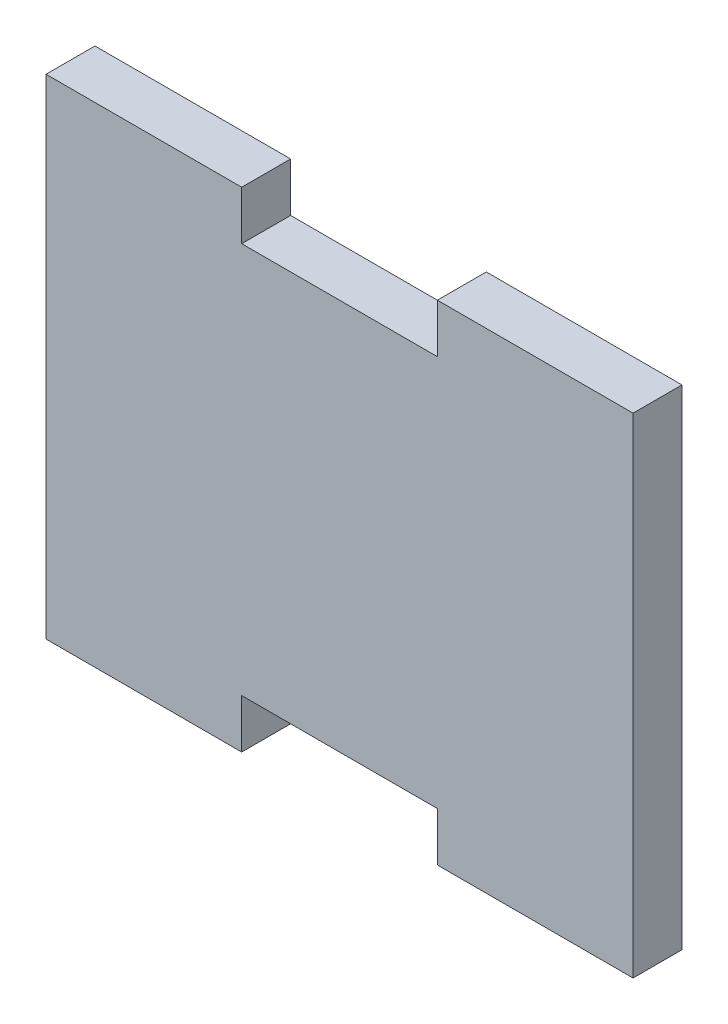
ISO-10303-21;
HEADER;
FILE_DESCRIPTION(('STEP AP214'),'2;1');
FILE_NAME('part.step','',(''),(''),'','','');
FILE_SCHEMA(('AUTOMOTIVE_DESIGN { 1 0 10303 214 1 1 1 1 }'));
ENDSEC;
DATA;
#1=APPLICATION_CONTEXT('core data for automotive mechanical design processes');
#2=APPLICATION_PROTOCOL_DEFINITION('international standard','automotive_design',2000,#1);
#3=PRODUCT_CONTEXT('',#1,'mechanical');
#4=PRODUCT('Part','Part','',(#3));
#5=PRODUCT_RELATED_PRODUCT_CATEGORY('part','',(#4));
#6=PRODUCT_DEFINITION_FORMATION('','',#4);
#7=PRODUCT_DEFINITION_CONTEXT('part definition',#1,'design');
#8=PRODUCT_DEFINITION('design','',#6,#7);
#9=PRODUCT_DEFINITION_SHAPE('','',#8);
#10=(LENGTH_UNIT() NAMED_UNIT(*) SI_UNIT(.MILLI.,.METRE.));
#11=(NAMED_UNIT(*) PLANE_ANGLE_UNIT() SI_UNIT($,.RADIAN.));
#12=(NAMED_UNIT(*) SI_UNIT($,.STERADIAN.) SOLID_ANGLE_UNIT());
#13=UNCERTAINTY_MEASURE_WITH_UNIT(LENGTH_MEASURE(1.E-05),#10,'distance_accuracy_value','');
#14=(GEOMETRIC_REPRESENTATION_CONTEXT(3) GLOBAL_UNCERTAINTY_ASSIGNED_CONTEXT((#13)) GLOBAL_UNIT_ASSIGNED_CONTEXT((#10,
#11,#12)) REPRESENTATION_CONTEXT('',''));
#15=CARTESIAN_POINT('',(0.,0.,0.));
#16=DIRECTION('',(0.,0.,1.));
#17=DIRECTION('',(1.,0.,0.));
#18=AXIS2_PLACEMENT_3D('',#15,#16,#17);
#19=CARTESIAN_POINT('',(0.,20.,5.));
#20=DIRECTION('',(0.,1.,0.));
#21=DIRECTION('',(0.,0.,1.));
#22=AXIS2_PLACEMENT_3D('',#19,#20,#21);
#23=PLANE('',#22);
#24=DIRECTION('',(0.,0.,1.));
#25=VECTOR('',#24,1.);
#26=CARTESIAN_POINT('',(10.,20.,5.));
#27=LINE('',#26,#25);
#28=CARTESIAN_POINT('',(10.,20.,0.));
#29=VERTEX_POINT('',#28);
#30=CARTESIAN_POINT('',(10.,20.,5.));
#31=VERTEX_POINT('',#30);
#32=EDGE_CURVE('E12',#29,#31,#27,.T.);
#33=ORIENTED_EDGE('',*,*,#32,.F.);
#34=DIRECTION('',(1.,0.,0.));
#35=VECTOR('',#34,1.);
#36=CARTESIAN_POINT('',(0.,20.,0.));
#37=LINE('',#36,#35);
#38=CARTESIAN_POINT('',(-10.,20.,0.));
#39=VERTEX_POINT('',#38);
#40=EDGE_CURVE('E128',#39,#29,#37,.T.);
#41=ORIENTED_EDGE('',*,*,#40,.F.);
#42=DIRECTION('',(0.,0.,-1.));
#43=VECTOR('',#42,1.);
#44=CARTESIAN_POINT('',(-10.,20.,5.));
#45=LINE('',#44,#43);
#46=CARTESIAN_POINT('',(-10.,20.,5.));
#47=VERTEX_POINT('',#46);
#48=EDGE_CURVE('E87',#47,#39,#45,.T.);
#49=ORIENTED_EDGE('',*,*,#48,.F.);
#50=DIRECTION('',(1.,0.,0.));
#51=VECTOR('',#50,1.);
#52=CARTESIAN_POINT('',(0.,20.,5.));
#53=LINE('',#52,#51);
#54=EDGE_CURVE('E217',#47,#31,#53,.T.);
#55=ORIENTED_EDGE('',*,*,#54,.T.);
#56=EDGE_LOOP('',(#33,#41,#49,#55));
#57=FACE_BOUND('',#56,.T.);
#58=ADVANCED_FACE('F77',(#57),#23,.T.);
#59=CARTESIAN_POINT('',(-10.,0.,5.));
#60=DIRECTION('',(-1.,0.,0.));
#61=DIRECTION('',(0.,0.,1.));
#62=AXIS2_PLACEMENT_3D('',#59,#60,#61);
#63=PLANE('',#62);
#64=DIRECTION('',(0.,1.,0.));
#65=VECTOR('',#64,1.);
#66=CARTESIAN_POINT('',(-10.,0.,0.));
#67=LINE('',#66,#65);
#68=CARTESIAN_POINT('',(-10.,25.,0.));
#69=VERTEX_POINT('',#68);
#70=EDGE_CURVE('E190',#39,#69,#67,.T.);
#71=ORIENTED_EDGE('',*,*,#70,.T.);
#72=DIRECTION('',(0.,0.,-1.));
#73=VECTOR('',#72,1.);
#74=CARTESIAN_POINT('',(-10.,25.,5.));
#75=LINE('',#74,#73);
#76=CARTESIAN_POINT('',(-10.,25.,5.));
#77=VERTEX_POINT('',#76);
#78=EDGE_CURVE('E146',#77,#69,#75,.T.);
#79=ORIENTED_EDGE('',*,*,#78,.F.);
#80=DIRECTION('',(0.,1.,0.));
#81=VECTOR('',#80,1.);
#82=CARTESIAN_POINT('',(-10.,0.,5.));
#83=LINE('',#82,#81);
#84=EDGE_CURVE('E214',#47,#77,#83,.T.);
#85=ORIENTED_EDGE('',*,*,#84,.F.);
#86=ORIENTED_EDGE('',*,*,#48,.T.);
#87=EDGE_LOOP('',(#71,#79,#85,#86));
#88=FACE_BOUND('',#87,.T.);
#89=ADVANCED_FACE('F295',(#88),#63,.F.);
#90=CARTESIAN_POINT('',(0.,25.,5.));
#91=DIRECTION('',(0.,1.,0.));
#92=DIRECTION('',(0.,0.,1.));
#93=AXIS2_PLACEMENT_3D('',#90,#91,#92);
#94=PLANE('',#93);
#95=DIRECTION('',(1.,0.,0.));
#96=VECTOR('',#95,1.);
#97=CARTESIAN_POINT('',(0.,25.,0.));
#98=LINE('',#97,#96);
#99=CARTESIAN_POINT('',(-30.,25.,0.));
#100=VERTEX_POINT('',#99);
#101=EDGE_CURVE('E187',#100,#69,#98,.T.);
#102=ORIENTED_EDGE('',*,*,#101,.F.);
#103=DIRECTION('',(0.,0.,-1.));
#104=VECTOR('',#103,1.);
#105=CARTESIAN_POINT('',(-30.,25.,5.));
#106=LINE('',#105,#104);
#107=CARTESIAN_POINT('',(-30.,25.,5.));
#108=VERTEX_POINT('',#107);
#109=EDGE_CURVE('E149',#108,#100,#106,.T.);
#110=ORIENTED_EDGE('',*,*,#109,.F.);
#111=DIRECTION('',(1.,0.,0.));
#112=VECTOR('',#111,1.);
#113=CARTESIAN_POINT('',(0.,25.,5.));
#114=LINE('',#113,#112);
#115=EDGE_CURVE('E211',#108,#77,#114,.T.);
#116=ORIENTED_EDGE('',*,*,#115,.T.);
#117=ORIENTED_EDGE('',*,*,#78,.T.);
#118=EDGE_LOOP('',(#102,#110,#116,#117));
#119=FACE_BOUND('',#118,.T.);
#120=ADVANCED_FACE('F300',(#119),#94,.T.);
#121=CARTESIAN_POINT('',(-30.,0.,5.));
#122=DIRECTION('',(1.,0.,0.));
#123=DIRECTION('',(0.,1.,0.));
#124=AXIS2_PLACEMENT_3D('',#121,#122,#123);
#125=PLANE('',#124);
#126=DIRECTION('',(0.,-1.,0.));
#127=VECTOR('',#126,1.);
#128=CARTESIAN_POINT('',(-30.,0.,0.));
#129=LINE('',#128,#127);
#130=CARTESIAN_POINT('',(-30.,-25.,0.));
#131=VERTEX_POINT('',#130);
#132=EDGE_CURVE('E184',#100,#131,#129,.T.);
#133=ORIENTED_EDGE('',*,*,#132,.T.);
#134=DIRECTION('',(0.,0.,-1.));
#135=VECTOR('',#134,1.);
#136=CARTESIAN_POINT('',(-30.,-25.,5.));
#137=LINE('',#136,#135);
#138=CARTESIAN_POINT('',(-30.,-25.,5.));
#139=VERTEX_POINT('',#138);
#140=EDGE_CURVE('E152',#139,#131,#137,.T.);
#141=ORIENTED_EDGE('',*,*,#140,.F.);
#142=DIRECTION('',(0.,-1.,0.));
#143=VECTOR('',#142,1.);
#144=CARTESIAN_POINT('',(-30.,0.,5.));
#145=LINE('',#144,#143);
#146=EDGE_CURVE('E208',#108,#139,#145,.T.);
#147=ORIENTED_EDGE('',*,*,#146,.F.);
#148=ORIENTED_EDGE('',*,*,#109,.T.);
#149=EDGE_LOOP('',(#133,#141,#147,#148));
#150=FACE_BOUND('',#149,.T.);
#151=ADVANCED_FACE('F356',(#150),#125,.F.);
#152=CARTESIAN_POINT('',(0.,-25.,5.));
#153=DIRECTION('',(0.,1.,0.));
#154=DIRECTION('',(-1.,0.,0.));
#155=AXIS2_PLACEMENT_3D('',#152,#153,#154);
#156=PLANE('',#155);
#157=DIRECTION('',(1.,0.,0.));
#158=VECTOR('',#157,1.);
#159=CARTESIAN_POINT('',(0.,-25.,0.));
#160=LINE('',#159,#158);
#161=CARTESIAN_POINT('',(-9.99999999999999,-25.,0.));
#162=VERTEX_POINT('',#161);
#163=EDGE_CURVE('E181',#131,#162,#160,.T.);
#164=ORIENTED_EDGE('',*,*,#163,.T.);
#165=DIRECTION('',(0.,0.,-1.));
#166=VECTOR('',#165,1.);
#167=CARTESIAN_POINT('',(-9.99999999999999,-25.,5.));
#168=LINE('',#167,#166);
#169=CARTESIAN_POINT('',(-9.99999999999999,-25.,5.));
#170=VERTEX_POINT('',#169);
#171=EDGE_CURVE('E155',#170,#162,#168,.T.);
#172=ORIENTED_EDGE('',*,*,#171,.F.);
#173=DIRECTION('',(1.,0.,0.));
#174=VECTOR('',#173,1.);
#175=CARTESIAN_POINT('',(0.,-25.,5.));
#176=LINE('',#175,#174);
#177=EDGE_CURVE('E205',#139,#170,#176,.T.);
#178=ORIENTED_EDGE('',*,*,#177,.F.);
#179=ORIENTED_EDGE('',*,*,#140,.T.);
#180=EDGE_LOOP('',(#164,#172,#178,#179));
#181=FACE_BOUND('',#180,.T.);
#182=ADVANCED_FACE('F280',(#181),#156,.F.);
#183=CARTESIAN_POINT('',(-10.,0.,5.));
#184=DIRECTION('',(1.,0.,0.));
#185=DIRECTION('',(0.,1.,0.));
#186=AXIS2_PLACEMENT_3D('',#183,#184,#185);
#187=PLANE('',#186);
#188=DIRECTION('',(0.,-1.,0.));
#189=VECTOR('',#188,1.);
#190=CARTESIAN_POINT('',(-10.,0.,0.));
#191=LINE('',#190,#189);
#192=CARTESIAN_POINT('',(-10.,-20.,0.));
#193=VERTEX_POINT('',#192);
#194=EDGE_CURVE('E178',#193,#162,#191,.T.);
#195=ORIENTED_EDGE('',*,*,#194,.F.);
#196=DIRECTION('',(0.,0.,-1.));
#197=VECTOR('',#196,1.);
#198=CARTESIAN_POINT('',(-10.,-20.,5.));
#199=LINE('',#198,#197);
#200=CARTESIAN_POINT('',(-10.,-20.,5.));
#201=VERTEX_POINT('',#200);
#202=EDGE_CURVE('E158',#201,#193,#199,.T.);
#203=ORIENTED_EDGE('',*,*,#202,.F.);
#204=DIRECTION('',(0.,-1.,0.));
#205=VECTOR('',#204,1.);
#206=CARTESIAN_POINT('',(-10.,0.,5.));
#207=LINE('',#206,#205);
#208=EDGE_CURVE('E202',#201,#170,#207,.T.);
#209=ORIENTED_EDGE('',*,*,#208,.T.);
#210=ORIENTED_EDGE('',*,*,#171,.T.);
#211=EDGE_LOOP('',(#195,#203,#209,#210));
#212=FACE_BOUND('',#211,.T.);
#213=ADVANCED_FACE('F268',(#212),#187,.T.);
#214=CARTESIAN_POINT('',(0.,-20.,5.));
#215=DIRECTION('',(0.,1.,0.));
#216=DIRECTION('',(0.,0.,1.));
#217=AXIS2_PLACEMENT_3D('',#214,#215,#216);
#218=PLANE('',#217);
#219=DIRECTION('',(1.,0.,0.));
#220=VECTOR('',#219,1.);
#221=CARTESIAN_POINT('',(0.,-20.,0.));
#222=LINE('',#221,#220);
#223=CARTESIAN_POINT('',(10.,-20.,0.));
#224=VERTEX_POINT('',#223);
#225=EDGE_CURVE('E175',#193,#224,#222,.T.);
#226=ORIENTED_EDGE('',*,*,#225,.T.);
#227=DIRECTION('',(0.,0.,-1.));
#228=VECTOR('',#227,1.);
#229=CARTESIAN_POINT('',(10.,-20.,5.));
#230=LINE('',#229,#228);
#231=CARTESIAN_POINT('',(10.,-20.,5.));
#232=VERTEX_POINT('',#231);
#233=EDGE_CURVE('E161',#232,#224,#230,.T.);
#234=ORIENTED_EDGE('',*,*,#233,.F.);
#235=DIRECTION('',(1.,0.,0.));
#236=VECTOR('',#235,1.);
#237=CARTESIAN_POINT('',(0.,-20.,5.));
#238=LINE('',#237,#236);
#239=EDGE_CURVE('E199',#201,#232,#238,.T.);
#240=ORIENTED_EDGE('',*,*,#239,.F.);
#241=ORIENTED_EDGE('',*,*,#202,.T.);
#242=EDGE_LOOP('',(#226,#234,#240,#241));
#243=FACE_BOUND('',#242,.T.);
#244=ADVANCED_FACE('F273',(#243),#218,.F.);
#245=CARTESIAN_POINT('',(9.99999999999999,0.,5.));
#246=DIRECTION('',(1.,0.,0.));
#247=DIRECTION('',(0.,1.,0.));
#248=AXIS2_PLACEMENT_3D('',#245,#246,#247);
#249=PLANE('',#248);
#250=DIRECTION('',(0.,-1.,0.));
#251=VECTOR('',#250,1.);
#252=CARTESIAN_POINT('',(9.99999999999999,0.,0.));
#253=LINE('',#252,#251);
#254=CARTESIAN_POINT('',(10.,-25.,0.));
#255=VERTEX_POINT('',#254);
#256=EDGE_CURVE('E172',#224,#255,#253,.T.);
#257=ORIENTED_EDGE('',*,*,#256,.T.);
#258=DIRECTION('',(0.,0.,-1.));
#259=VECTOR('',#258,1.);
#260=CARTESIAN_POINT('',(10.,-25.,5.));
#261=LINE('',#260,#259);
#262=CARTESIAN_POINT('',(10.,-25.,5.));
#263=VERTEX_POINT('',#262);
#264=EDGE_CURVE('E164',#263,#255,#261,.T.);
#265=ORIENTED_EDGE('',*,*,#264,.F.);
#266=DIRECTION('',(0.,-1.,0.));
#267=VECTOR('',#266,1.);
#268=CARTESIAN_POINT('',(9.99999999999999,0.,5.));
#269=LINE('',#268,#267);
#270=EDGE_CURVE('E196',#232,#263,#269,.T.);
#271=ORIENTED_EDGE('',*,*,#270,.F.);
#272=ORIENTED_EDGE('',*,*,#233,.T.);
#273=EDGE_LOOP('',(#257,#265,#271,#272));
#274=FACE_BOUND('',#273,.T.);
#275=ADVANCED_FACE('F285',(#274),#249,.F.);
#276=CARTESIAN_POINT('',(0.,-25.,5.));
#277=DIRECTION('',(0.,-1.,0.));
#278=DIRECTION('',(1.,0.,0.));
#279=AXIS2_PLACEMENT_3D('',#276,#277,#278);
#280=PLANE('',#279);
#281=DIRECTION('',(-1.,0.,0.));
#282=VECTOR('',#281,1.);
#283=CARTESIAN_POINT('',(0.,-25.,0.));
#284=LINE('',#283,#282);
#285=CARTESIAN_POINT('',(30.,-25.,0.));
#286=VERTEX_POINT('',#285);
#287=EDGE_CURVE('E169',#286,#255,#284,.T.);
#288=ORIENTED_EDGE('',*,*,#287,.F.);
#289=DIRECTION('',(0.,0.,-1.));
#290=VECTOR('',#289,1.);
#291=CARTESIAN_POINT('',(30.,-25.,5.));
#292=LINE('',#291,#290);
#293=CARTESIAN_POINT('',(30.,-25.,5.));
#294=VERTEX_POINT('',#293);
#295=EDGE_CURVE('E123',#294,#286,#292,.T.);
#296=ORIENTED_EDGE('',*,*,#295,.F.);
#297=DIRECTION('',(-1.,0.,0.));
#298=VECTOR('',#297,1.);
#299=CARTESIAN_POINT('',(0.,-25.,5.));
#300=LINE('',#299,#298);
#301=EDGE_CURVE('E168',#294,#263,#300,.T.);
#302=ORIENTED_EDGE('',*,*,#301,.T.);
#303=ORIENTED_EDGE('',*,*,#264,.T.);
#304=EDGE_LOOP('',(#288,#296,#302,#303));
#305=FACE_BOUND('',#304,.T.);
#306=ADVANCED_FACE('F228',(#305),#280,.T.);
#307=CARTESIAN_POINT('',(30.,0.,5.));
#308=DIRECTION('',(1.,0.,0.));
#309=DIRECTION('',(0.,1.,0.));
#310=AXIS2_PLACEMENT_3D('',#307,#308,#309);
#311=PLANE('',#310);
#312=DIRECTION('',(0.,-1.,0.));
#313=VECTOR('',#312,1.);
#314=CARTESIAN_POINT('',(30.,0.,0.));
#315=LINE('',#314,#313);
#316=CARTESIAN_POINT('',(30.,25.,0.));
#317=VERTEX_POINT('',#316);
#318=EDGE_CURVE('E115',#317,#286,#315,.T.);
#319=ORIENTED_EDGE('',*,*,#318,.F.);
#320=DIRECTION('',(0.,0.,-1.));
#321=VECTOR('',#320,1.);
#322=CARTESIAN_POINT('',(30.,25.,5.));
#323=LINE('',#322,#321);
#324=CARTESIAN_POINT('',(30.,25.,5.));
#325=VERTEX_POINT('',#324);
#326=EDGE_CURVE('E119',#325,#317,#323,.T.);
#327=ORIENTED_EDGE('',*,*,#326,.F.);
#328=DIRECTION('',(0.,-1.,0.));
#329=VECTOR('',#328,1.);
#330=CARTESIAN_POINT('',(30.,0.,5.));
#331=LINE('',#330,#329);
#332=EDGE_CURVE('E171',#325,#294,#331,.T.);
#333=ORIENTED_EDGE('',*,*,#332,.T.);
#334=ORIENTED_EDGE('',*,*,#295,.T.);
#335=EDGE_LOOP('',(#319,#327,#333,#334));
#336=FACE_BOUND('',#335,.T.);
#337=ADVANCED_FACE('F117',(#336),#311,.T.);
#338=CARTESIAN_POINT('',(0.,0.,0.));
#339=DIRECTION('',(0.,0.,1.));
#340=DIRECTION('',(1.,0.,0.));
#341=AXIS2_PLACEMENT_3D('',#338,#339,#340);
#342=PLANE('',#341);
#343=ORIENTED_EDGE('',*,*,#318,.T.);
#344=ORIENTED_EDGE('',*,*,#287,.T.);
#345=ORIENTED_EDGE('',*,*,#256,.F.);
#346=ORIENTED_EDGE('',*,*,#225,.F.);
#347=ORIENTED_EDGE('',*,*,#194,.T.);
#348=ORIENTED_EDGE('',*,*,#163,.F.);
#349=ORIENTED_EDGE('',*,*,#132,.F.);
#350=ORIENTED_EDGE('',*,*,#101,.T.);
#351=ORIENTED_EDGE('',*,*,#70,.F.);
#352=ORIENTED_EDGE('',*,*,#40,.T.);
#353=DIRECTION('',(0.,1.,0.));
#354=VECTOR('',#353,1.);
#355=CARTESIAN_POINT('',(10.,20.,0.));
#356=LINE('',#355,#354);
#357=CARTESIAN_POINT('',(10.,25.,0.));
#358=VERTEX_POINT('',#357);
#359=EDGE_CURVE('E137',#29,#358,#356,.T.);
#360=ORIENTED_EDGE('',*,*,#359,.T.);
#361=DIRECTION('',(-1.,0.,0.));
#362=VECTOR('',#361,1.);
#363=CARTESIAN_POINT('',(30.,25.,0.));
#364=LINE('',#363,#362);
#365=EDGE_CURVE('E132',#317,#358,#364,.T.);
#366=ORIENTED_EDGE('',*,*,#365,.F.);
#367=EDGE_LOOP('',(#343,#344,#345,#346,#347,#348,#349,#350,#351,#352,#360,#366));
#368=FACE_BOUND('',#367,.T.);
#369=ADVANCED_FACE('F135',(#368),#342,.F.);
#370=CARTESIAN_POINT('',(0.,0.,5.));
#371=DIRECTION('',(0.,0.,1.));
#372=DIRECTION('',(1.,0.,0.));
#373=AXIS2_PLACEMENT_3D('',#370,#371,#372);
#374=PLANE('',#373);
#375=ORIENTED_EDGE('',*,*,#332,.F.);
#376=DIRECTION('',(-1.,0.,0.));
#377=VECTOR('',#376,1.);
#378=CARTESIAN_POINT('',(30.,25.,5.));
#379=LINE('',#378,#377);
#380=CARTESIAN_POINT('',(10.,25.,5.));
#381=VERTEX_POINT('',#380);
#382=EDGE_CURVE('E134',#325,#381,#379,.T.);
#383=ORIENTED_EDGE('',*,*,#382,.T.);
#384=DIRECTION('',(0.,1.,0.));
#385=VECTOR('',#384,1.);
#386=CARTESIAN_POINT('',(10.,20.,5.));
#387=LINE('',#386,#385);
#388=EDGE_CURVE('E138',#31,#381,#387,.T.);
#389=ORIENTED_EDGE('',*,*,#388,.F.);
#390=ORIENTED_EDGE('',*,*,#54,.F.);
#391=ORIENTED_EDGE('',*,*,#84,.T.);
#392=ORIENTED_EDGE('',*,*,#115,.F.);
#393=ORIENTED_EDGE('',*,*,#146,.T.);
#394=ORIENTED_EDGE('',*,*,#177,.T.);
#395=ORIENTED_EDGE('',*,*,#208,.F.);
#396=ORIENTED_EDGE('',*,*,#239,.T.);
#397=ORIENTED_EDGE('',*,*,#270,.T.);
#398=ORIENTED_EDGE('',*,*,#301,.F.);
#399=EDGE_LOOP('',(#375,#383,#389,#390,#391,#392,#393,#394,#395,#396,#397,#398));
#400=FACE_BOUND('',#399,.T.);
#401=ADVANCED_FACE('F224',(#400),#374,.T.);
#402=CARTESIAN_POINT('',(30.,25.,5.));
#403=DIRECTION('',(0.,-1.,0.));
#404=DIRECTION('',(1.,0.,0.));
#405=AXIS2_PLACEMENT_3D('',#402,#403,#404);
#406=PLANE('',#405);
#407=ORIENTED_EDGE('',*,*,#365,.T.);
#408=DIRECTION('',(0.,0.,-1.));
#409=VECTOR('',#408,1.);
#410=CARTESIAN_POINT('',(10.,25.,5.));
#411=LINE('',#410,#409);
#412=EDGE_CURVE('E81',#381,#358,#411,.T.);
#413=ORIENTED_EDGE('',*,*,#412,.F.);
#414=ORIENTED_EDGE('',*,*,#382,.F.);
#415=ORIENTED_EDGE('',*,*,#326,.T.);
#416=EDGE_LOOP('',(#407,#413,#414,#415));
#417=FACE_BOUND('',#416,.T.);
#418=ADVANCED_FACE('F131',(#417),#406,.F.);
#419=CARTESIAN_POINT('',(10.,20.,5.));
#420=DIRECTION('',(-1.,0.,0.));
#421=DIRECTION('',(0.,0.,1.));
#422=AXIS2_PLACEMENT_3D('',#419,#420,#421);
#423=PLANE('',#422);
#424=ORIENTED_EDGE('',*,*,#359,.F.);
#425=ORIENTED_EDGE('',*,*,#32,.T.);
#426=ORIENTED_EDGE('',*,*,#388,.T.);
#427=ORIENTED_EDGE('',*,*,#412,.T.);
#428=EDGE_LOOP('',(#424,#425,#426,#427));
#429=FACE_BOUND('',#428,.T.);
#430=ADVANCED_FACE('F79',(#429),#423,.T.);
#431=CLOSED_SHELL('',(#58,#89,#120,#151,#182,#213,#244,#275,#306,#337,#369,#401,#418,#430));
#432=MANIFOLD_SOLID_BREP('B2',#431);
#433=ADVANCED_BREP_SHAPE_REPRESENTATION('',(#18,#432),#14);
#434=SHAPE_DEFINITION_REPRESENTATION(#9,#433);
ENDSEC;
END-ISO-10303-21;
